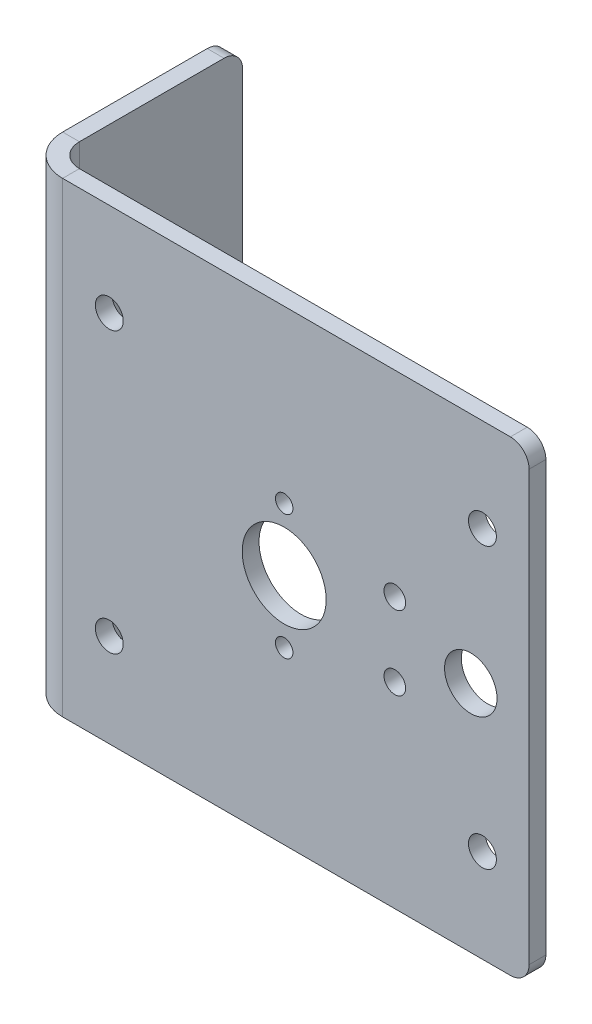
ISO-10303-21;
HEADER;
FILE_DESCRIPTION(('STEP AP214'),'2;1');
FILE_NAME('part.step','',(''),(''),'','','');
FILE_SCHEMA(('AUTOMOTIVE_DESIGN { 1 0 10303 214 1 1 1 1 }'));
ENDSEC;
DATA;
#1=APPLICATION_CONTEXT('core data for automotive mechanical design processes');
#2=APPLICATION_PROTOCOL_DEFINITION('international standard','automotive_design',2000,#1);
#3=PRODUCT_CONTEXT('',#1,'mechanical');
#4=PRODUCT('Part','Part','',(#3));
#5=PRODUCT_RELATED_PRODUCT_CATEGORY('part','',(#4));
#6=PRODUCT_DEFINITION_FORMATION('','',#4);
#7=PRODUCT_DEFINITION_CONTEXT('part definition',#1,'design');
#8=PRODUCT_DEFINITION('design','',#6,#7);
#9=PRODUCT_DEFINITION_SHAPE('','',#8);
#10=(LENGTH_UNIT() NAMED_UNIT(*) SI_UNIT(.MILLI.,.METRE.));
#11=(NAMED_UNIT(*) PLANE_ANGLE_UNIT() SI_UNIT($,.RADIAN.));
#12=(NAMED_UNIT(*) SI_UNIT($,.STERADIAN.) SOLID_ANGLE_UNIT());
#13=UNCERTAINTY_MEASURE_WITH_UNIT(LENGTH_MEASURE(1.E-05),#10,'distance_accuracy_value','');
#14=(GEOMETRIC_REPRESENTATION_CONTEXT(3) GLOBAL_UNCERTAINTY_ASSIGNED_CONTEXT((#13)) GLOBAL_UNIT_ASSIGNED_CONTEXT((#10,
#11,#12)) REPRESENTATION_CONTEXT('',''));
#15=CARTESIAN_POINT('',(0.,0.,0.));
#16=DIRECTION('',(0.,0.,1.));
#17=DIRECTION('',(1.,0.,0.));
#18=AXIS2_PLACEMENT_3D('',#15,#16,#17);
#19=CARTESIAN_POINT('',(-30.1625,31.75,0.));
#20=DIRECTION('',(0.,1.,0.));
#21=DIRECTION('',(0.,0.,1.));
#22=AXIS2_PLACEMENT_3D('',#19,#20,#21);
#23=PLANE('',#22);
#24=DIRECTION('',(0.,0.,1.));
#25=VECTOR('',#24,1.);
#26=CARTESIAN_POINT('',(-30.1625,31.75,0.));
#27=LINE('',#26,#25);
#28=CARTESIAN_POINT('',(-30.1625,31.75,0.));
#29=VERTEX_POINT('',#28);
#30=CARTESIAN_POINT('',(-30.1625,31.75,2.28600000000001));
#31=VERTEX_POINT('',#30);
#32=EDGE_CURVE('E150',#29,#31,#27,.T.);
#33=ORIENTED_EDGE('',*,*,#32,.F.);
#34=CARTESIAN_POINT('',(-30.1625,31.75,-3.17499999999999));
#35=DIRECTION('',(0.,1.,0.));
#36=DIRECTION('',(0.,0.,1.));
#37=AXIS2_PLACEMENT_3D('',#34,#35,#36);
#38=CIRCLE('',#37,3.175);
#39=CARTESIAN_POINT('',(-33.3375,31.75,-3.17499999999999));
#40=VERTEX_POINT('',#39);
#41=EDGE_CURVE('E147',#29,#40,#38,.F.);
#42=ORIENTED_EDGE('',*,*,#41,.T.);
#43=DIRECTION('',(1.,0.,0.));
#44=VECTOR('',#43,1.);
#45=CARTESIAN_POINT('',(-35.6235,31.75,-3.17499999999999));
#46=LINE('',#45,#44);
#47=CARTESIAN_POINT('',(-35.6235,31.75,-3.17499999999999));
#48=VERTEX_POINT('',#47);
#49=EDGE_CURVE('E141',#48,#40,#46,.T.);
#50=ORIENTED_EDGE('',*,*,#49,.F.);
#51=CARTESIAN_POINT('',(-30.1625,31.75,-3.17499999999999));
#52=DIRECTION('',(0.,1.,0.));
#53=DIRECTION('',(-1.,0.,0.));
#54=AXIS2_PLACEMENT_3D('',#51,#52,#53);
#55=CIRCLE('',#54,5.461);
#56=EDGE_CURVE('E145',#31,#48,#55,.F.);
#57=ORIENTED_EDGE('',*,*,#56,.F.);
#58=EDGE_LOOP('',(#33,#42,#50,#57));
#59=FACE_BOUND('',#58,.T.);
#60=ADVANCED_FACE('F47',(#59),#23,.T.);
#61=CARTESIAN_POINT('',(-35.6235,31.75,-3.17499999999999));
#62=DIRECTION('',(0.,1.,0.));
#63=DIRECTION('',(0.,0.,1.));
#64=AXIS2_PLACEMENT_3D('',#61,#62,#63);
#65=PLANE('',#64);
#66=DIRECTION('',(-1.,0.,0.));
#67=VECTOR('',#66,1.);
#68=CARTESIAN_POINT('',(33.3375,31.75,2.286));
#69=LINE('',#68,#67);
#70=CARTESIAN_POINT('',(30.7975,31.75,2.286));
#71=VERTEX_POINT('',#70);
#72=EDGE_CURVE('E177',#71,#31,#69,.T.);
#73=ORIENTED_EDGE('',*,*,#72,.F.);
#74=DIRECTION('',(0.,0.,1.));
#75=VECTOR('',#74,1.);
#76=CARTESIAN_POINT('',(30.7975,31.75,-3.17499999999999));
#77=LINE('',#76,#75);
#78=CARTESIAN_POINT('',(30.7975,31.75,0.));
#79=VERTEX_POINT('',#78);
#80=EDGE_CURVE('E11',#71,#79,#77,.F.);
#81=ORIENTED_EDGE('',*,*,#80,.T.);
#82=DIRECTION('',(-1.,0.,0.));
#83=VECTOR('',#82,1.);
#84=CARTESIAN_POINT('',(33.3375,31.75,0.));
#85=LINE('',#84,#83);
#86=EDGE_CURVE('E180',#79,#29,#85,.T.);
#87=ORIENTED_EDGE('',*,*,#86,.T.);
#88=ORIENTED_EDGE('',*,*,#32,.T.);
#89=EDGE_LOOP('',(#73,#81,#87,#88));
#90=FACE_BOUND('',#89,.T.);
#91=ADVANCED_FACE('F381',(#90),#65,.T.);
#92=CARTESIAN_POINT('',(-33.3375,-31.75,-3.17499999999999));
#93=DIRECTION('',(0.,-1.,0.));
#94=DIRECTION('',(0.,0.,-1.));
#95=AXIS2_PLACEMENT_3D('',#92,#93,#94);
#96=PLANE('',#95);
#97=DIRECTION('',(-1.,0.,0.));
#98=VECTOR('',#97,1.);
#99=CARTESIAN_POINT('',(-33.3375,-31.75,-3.17499999999999));
#100=LINE('',#99,#98);
#101=CARTESIAN_POINT('',(-33.3375,-31.75,-3.17499999999999));
#102=VERTEX_POINT('',#101);
#103=CARTESIAN_POINT('',(-35.6235,-31.75,-3.17499999999999));
#104=VERTEX_POINT('',#103);
#105=EDGE_CURVE('E151',#102,#104,#100,.T.);
#106=ORIENTED_EDGE('',*,*,#105,.F.);
#107=CARTESIAN_POINT('',(-30.1625,-31.75,-3.17499999999999));
#108=DIRECTION('',(0.,1.,0.));
#109=DIRECTION('',(0.,0.,1.));
#110=AXIS2_PLACEMENT_3D('',#107,#108,#109);
#111=CIRCLE('',#110,3.175);
#112=CARTESIAN_POINT('',(-30.1625,-31.75,0.));
#113=VERTEX_POINT('',#112);
#114=EDGE_CURVE('E205',#113,#102,#111,.F.);
#115=ORIENTED_EDGE('',*,*,#114,.F.);
#116=DIRECTION('',(0.,0.,-1.));
#117=VECTOR('',#116,1.);
#118=CARTESIAN_POINT('',(-30.1625,-31.75,2.28600000000001));
#119=LINE('',#118,#117);
#120=CARTESIAN_POINT('',(-30.1625,-31.75,2.28600000000001));
#121=VERTEX_POINT('',#120);
#122=EDGE_CURVE('E231',#121,#113,#119,.T.);
#123=ORIENTED_EDGE('',*,*,#122,.F.);
#124=CARTESIAN_POINT('',(-30.1625,-31.75,-3.17499999999999));
#125=DIRECTION('',(0.,1.,0.));
#126=DIRECTION('',(-1.,0.,0.));
#127=AXIS2_PLACEMENT_3D('',#124,#125,#126);
#128=CIRCLE('',#127,5.461);
#129=EDGE_CURVE('E196',#121,#104,#128,.F.);
#130=ORIENTED_EDGE('',*,*,#129,.T.);
#131=EDGE_LOOP('',(#106,#115,#123,#130));
#132=FACE_BOUND('',#131,.T.);
#133=ADVANCED_FACE('F360',(#132),#96,.T.);
#134=CARTESIAN_POINT('',(-30.1625,-31.75,2.28600000000001));
#135=DIRECTION('',(0.,-1.,0.));
#136=DIRECTION('',(0.,0.,-1.));
#137=AXIS2_PLACEMENT_3D('',#134,#135,#136);
#138=PLANE('',#137);
#139=DIRECTION('',(0.,0.,1.));
#140=VECTOR('',#139,1.);
#141=CARTESIAN_POINT('',(-35.6235,-31.75,0.));
#142=LINE('',#141,#140);
#143=CARTESIAN_POINT('',(-35.6235,-31.75,-22.86));
#144=VERTEX_POINT('',#143);
#145=EDGE_CURVE('E161',#104,#144,#142,.F.);
#146=ORIENTED_EDGE('',*,*,#145,.T.);
#147=DIRECTION('',(1.,0.,0.));
#148=VECTOR('',#147,1.);
#149=CARTESIAN_POINT('',(-30.1625,-31.75,-22.86));
#150=LINE('',#149,#148);
#151=CARTESIAN_POINT('',(-33.3375,-31.75,-22.86));
#152=VERTEX_POINT('',#151);
#153=EDGE_CURVE('E263',#144,#152,#150,.T.);
#154=ORIENTED_EDGE('',*,*,#153,.T.);
#155=DIRECTION('',(0.,0.,-1.));
#156=VECTOR('',#155,1.);
#157=CARTESIAN_POINT('',(-33.3375,-31.75,0.));
#158=LINE('',#157,#156);
#159=EDGE_CURVE('E189',#102,#152,#158,.T.);
#160=ORIENTED_EDGE('',*,*,#159,.F.);
#161=ORIENTED_EDGE('',*,*,#105,.T.);
#162=EDGE_LOOP('',(#146,#154,#160,#161));
#163=FACE_BOUND('',#162,.T.);
#164=ADVANCED_FACE('F357',(#163),#138,.T.);
#165=CARTESIAN_POINT('',(-33.3375,31.75,0.));
#166=DIRECTION('',(-1.,0.,0.));
#167=DIRECTION('',(0.,0.,1.));
#168=AXIS2_PLACEMENT_3D('',#165,#166,#167);
#169=PLANE('',#168);
#170=ORIENTED_EDGE('',*,*,#159,.T.);
#171=CARTESIAN_POINT('',(-33.3375,-29.21,-22.86));
#172=DIRECTION('',(-1.,0.,0.));
#173=DIRECTION('',(0.,0.,1.));
#174=AXIS2_PLACEMENT_3D('',#171,#172,#173);
#175=CIRCLE('',#174,2.54);
#176=CARTESIAN_POINT('',(-33.3375,-29.21,-25.4));
#177=VERTEX_POINT('',#176);
#178=EDGE_CURVE('E270',#152,#177,#175,.F.);
#179=ORIENTED_EDGE('',*,*,#178,.T.);
#180=DIRECTION('',(0.,-1.,0.));
#181=VECTOR('',#180,1.);
#182=CARTESIAN_POINT('',(-33.3375,31.75,-25.4));
#183=LINE('',#182,#181);
#184=CARTESIAN_POINT('',(-33.3375,29.21,-25.4));
#185=VERTEX_POINT('',#184);
#186=EDGE_CURVE('E228',#185,#177,#183,.T.);
#187=ORIENTED_EDGE('',*,*,#186,.F.);
#188=CARTESIAN_POINT('',(-33.3375,29.21,-22.86));
#189=DIRECTION('',(-1.,0.,0.));
#190=DIRECTION('',(0.,0.,1.));
#191=AXIS2_PLACEMENT_3D('',#188,#189,#190);
#192=CIRCLE('',#191,2.54);
#193=CARTESIAN_POINT('',(-33.3375,31.75,-22.86));
#194=VERTEX_POINT('',#193);
#195=EDGE_CURVE('E267',#185,#194,#192,.F.);
#196=ORIENTED_EDGE('',*,*,#195,.T.);
#197=DIRECTION('',(0.,0.,-1.));
#198=VECTOR('',#197,1.);
#199=CARTESIAN_POINT('',(-33.3375,31.75,0.));
#200=LINE('',#199,#198);
#201=EDGE_CURVE('E171',#40,#194,#200,.T.);
#202=ORIENTED_EDGE('',*,*,#201,.F.);
#203=DIRECTION('',(0.,-1.,0.));
#204=VECTOR('',#203,1.);
#205=CARTESIAN_POINT('',(-33.3375,31.75,-3.17499999999999));
#206=LINE('',#205,#204);
#207=EDGE_CURVE('E188',#40,#102,#206,.T.);
#208=ORIENTED_EDGE('',*,*,#207,.T.);
#209=EDGE_LOOP('',(#170,#179,#187,#196,#202,#208));
#210=FACE_BOUND('',#209,.T.);
#211=ADVANCED_FACE('F351',(#210),#169,.F.);
#212=CARTESIAN_POINT('',(-35.6235,31.75,-25.4));
#213=DIRECTION('',(0.,0.,-1.));
#214=DIRECTION('',(-1.,0.,0.));
#215=AXIS2_PLACEMENT_3D('',#212,#213,#214);
#216=PLANE('',#215);
#217=ORIENTED_EDGE('',*,*,#186,.T.);
#218=DIRECTION('',(1.,0.,0.));
#219=VECTOR('',#218,1.);
#220=CARTESIAN_POINT('',(-35.6235,-29.21,-25.4));
#221=LINE('',#220,#219);
#222=CARTESIAN_POINT('',(-35.6235,-29.21,-25.4));
#223=VERTEX_POINT('',#222);
#224=EDGE_CURVE('E72',#177,#223,#221,.F.);
#225=ORIENTED_EDGE('',*,*,#224,.T.);
#226=DIRECTION('',(0.,-1.,0.));
#227=VECTOR('',#226,1.);
#228=CARTESIAN_POINT('',(-35.6235,31.75,-25.4));
#229=LINE('',#228,#227);
#230=CARTESIAN_POINT('',(-35.6235,29.21,-25.4));
#231=VERTEX_POINT('',#230);
#232=EDGE_CURVE('E166',#231,#223,#229,.T.);
#233=ORIENTED_EDGE('',*,*,#232,.F.);
#234=DIRECTION('',(1.,0.,0.));
#235=VECTOR('',#234,1.);
#236=CARTESIAN_POINT('',(-35.6235,29.21,-25.4));
#237=LINE('',#236,#235);
#238=EDGE_CURVE('E273',#231,#185,#237,.T.);
#239=ORIENTED_EDGE('',*,*,#238,.T.);
#240=EDGE_LOOP('',(#217,#225,#233,#239));
#241=FACE_BOUND('',#240,.T.);
#242=ADVANCED_FACE('F349',(#241),#216,.T.);
#243=CARTESIAN_POINT('',(-35.6235,31.75,0.));
#244=DIRECTION('',(-1.,0.,0.));
#245=DIRECTION('',(0.,0.,1.));
#246=AXIS2_PLACEMENT_3D('',#243,#244,#245);
#247=PLANE('',#246);
#248=ORIENTED_EDGE('',*,*,#232,.T.);
#249=CARTESIAN_POINT('',(-35.6235,-29.21,-22.86));
#250=DIRECTION('',(-1.,0.,0.));
#251=DIRECTION('',(0.,0.,1.));
#252=AXIS2_PLACEMENT_3D('',#249,#250,#251);
#253=CIRCLE('',#252,2.54);
#254=EDGE_CURVE('E282',#223,#144,#253,.T.);
#255=ORIENTED_EDGE('',*,*,#254,.T.);
#256=ORIENTED_EDGE('',*,*,#145,.F.);
#257=DIRECTION('',(0.,-1.,0.));
#258=VECTOR('',#257,1.);
#259=CARTESIAN_POINT('',(-35.6235,31.75,-3.17499999999999));
#260=LINE('',#259,#258);
#261=EDGE_CURVE('E156',#48,#104,#260,.T.);
#262=ORIENTED_EDGE('',*,*,#261,.F.);
#263=DIRECTION('',(0.,0.,1.));
#264=VECTOR('',#263,1.);
#265=CARTESIAN_POINT('',(-35.6235,31.75,0.));
#266=LINE('',#265,#264);
#267=CARTESIAN_POINT('',(-35.6235,31.75,-22.86));
#268=VERTEX_POINT('',#267);
#269=EDGE_CURVE('E158',#48,#268,#266,.F.);
#270=ORIENTED_EDGE('',*,*,#269,.T.);
#271=CARTESIAN_POINT('',(-35.6235,29.21,-22.86));
#272=DIRECTION('',(-1.,0.,0.));
#273=DIRECTION('',(0.,0.,1.));
#274=AXIS2_PLACEMENT_3D('',#271,#272,#273);
#275=CIRCLE('',#274,2.54);
#276=EDGE_CURVE('E279',#268,#231,#275,.T.);
#277=ORIENTED_EDGE('',*,*,#276,.T.);
#278=EDGE_LOOP('',(#248,#255,#256,#262,#270,#277));
#279=FACE_BOUND('',#278,.T.);
#280=ADVANCED_FACE('F157',(#279),#247,.T.);
#281=CARTESIAN_POINT('',(-30.1625,31.75,-3.17499999999999));
#282=DIRECTION('',(0.,-1.,0.));
#283=DIRECTION('',(0.,0.,-1.));
#284=AXIS2_PLACEMENT_3D('',#281,#282,#283);
#285=CYLINDRICAL_SURFACE('',#284,5.461);
#286=ORIENTED_EDGE('',*,*,#129,.F.);
#287=DIRECTION('',(0.,-1.,0.));
#288=VECTOR('',#287,1.);
#289=CARTESIAN_POINT('',(-30.1625,31.75,2.28600000000001));
#290=LINE('',#289,#288);
#291=EDGE_CURVE('E167',#31,#121,#290,.T.);
#292=ORIENTED_EDGE('',*,*,#291,.F.);
#293=ORIENTED_EDGE('',*,*,#56,.T.);
#294=ORIENTED_EDGE('',*,*,#261,.T.);
#295=EDGE_LOOP('',(#286,#292,#293,#294));
#296=FACE_BOUND('',#295,.T.);
#297=ADVANCED_FACE('F174',(#296),#285,.T.);
#298=CARTESIAN_POINT('',(33.3375,31.75,2.286));
#299=DIRECTION('',(0.,0.,1.));
#300=DIRECTION('',(1.,0.,0.));
#301=AXIS2_PLACEMENT_3D('',#298,#299,#300);
#302=PLANE('',#301);
#303=CARTESIAN_POINT('',(15.0578841816037,5.027499276321,2.28600000000001));
#304=DIRECTION('',(0.,0.,1.));
#305=DIRECTION('',(1.,0.,0.));
#306=AXIS2_PLACEMENT_3D('',#303,#304,#305);
#307=CIRCLE('',#306,1.4732);
#308=CARTESIAN_POINT('',(16.5310841816037,5.027499276321,2.28600000000001));
#309=VERTEX_POINT('',#308);
#310=EDGE_CURVE('E472',#309,#309,#307,.T.);
#311=ORIENTED_EDGE('',*,*,#310,.F.);
#312=EDGE_LOOP('',(#311));
#313=FACE_BOUND('',#312,.T.);
#314=CARTESIAN_POINT('',(15.0578841816037,-5.027499276321,2.28600000000001));
#315=DIRECTION('',(0.,0.,1.));
#316=DIRECTION('',(1.,0.,0.));
#317=AXIS2_PLACEMENT_3D('',#314,#315,#316);
#318=CIRCLE('',#317,1.4732);
#319=CARTESIAN_POINT('',(16.5310841816037,-5.027499276321,2.28600000000001));
#320=VERTEX_POINT('',#319);
#321=EDGE_CURVE('E476',#320,#320,#318,.T.);
#322=ORIENTED_EDGE('',*,*,#321,.F.);
#323=EDGE_LOOP('',(#322));
#324=FACE_BOUND('',#323,.T.);
#325=CARTESIAN_POINT('',(0.,8.5,2.28600000000001));
#326=DIRECTION('',(0.,0.,1.));
#327=DIRECTION('',(1.,0.,0.));
#328=AXIS2_PLACEMENT_3D('',#325,#326,#327);
#329=CIRCLE('',#328,1.190625);
#330=CARTESIAN_POINT('',(1.190625,8.5,2.28600000000001));
#331=VERTEX_POINT('',#330);
#332=EDGE_CURVE('E487',#331,#331,#329,.T.);
#333=ORIENTED_EDGE('',*,*,#332,.F.);
#334=EDGE_LOOP('',(#333));
#335=FACE_BOUND('',#334,.T.);
#336=CARTESIAN_POINT('',(0.,-8.5,2.28600000000001));
#337=DIRECTION('',(0.,0.,1.));
#338=DIRECTION('',(1.,0.,0.));
#339=AXIS2_PLACEMENT_3D('',#336,#337,#338);
#340=CIRCLE('',#339,1.190625);
#341=CARTESIAN_POINT('',(1.190625,-8.5,2.28600000000001));
#342=VERTEX_POINT('',#341);
#343=EDGE_CURVE('E324',#342,#342,#340,.T.);
#344=ORIENTED_EDGE('',*,*,#343,.F.);
#345=EDGE_LOOP('',(#344));
#346=FACE_BOUND('',#345,.T.);
#347=CARTESIAN_POINT('',(25.4,0.,2.28600000000001));
#348=DIRECTION('',(0.,0.,1.));
#349=DIRECTION('',(1.,0.,0.));
#350=AXIS2_PLACEMENT_3D('',#347,#348,#349);
#351=CIRCLE('',#350,3.571875);
#352=CARTESIAN_POINT('',(28.971875,0.,2.28600000000001));
#353=VERTEX_POINT('',#352);
#354=EDGE_CURVE('E310',#353,#353,#351,.T.);
#355=ORIENTED_EDGE('',*,*,#354,.F.);
#356=EDGE_LOOP('',(#355));
#357=FACE_BOUND('',#356,.T.);
#358=CARTESIAN_POINT('',(0.,0.,2.28600000000001));
#359=DIRECTION('',(0.,0.,1.));
#360=DIRECTION('',(1.,0.,0.));
#361=AXIS2_PLACEMENT_3D('',#358,#359,#360);
#362=CIRCLE('',#361,5.715);
#363=CARTESIAN_POINT('',(5.715,0.,2.28600000000001));
#364=VERTEX_POINT('',#363);
#365=EDGE_CURVE('E306',#364,#364,#362,.T.);
#366=ORIENTED_EDGE('',*,*,#365,.F.);
#367=EDGE_LOOP('',(#366));
#368=FACE_BOUND('',#367,.T.);
#369=CARTESIAN_POINT('',(-23.8125,19.05,2.28600000000001));
#370=DIRECTION('',(0.,0.,1.));
#371=DIRECTION('',(1.,0.,0.));
#372=AXIS2_PLACEMENT_3D('',#369,#370,#371);
#373=CIRCLE('',#372,1.89865);
#374=CARTESIAN_POINT('',(-21.91385,19.05,2.28600000000001));
#375=VERTEX_POINT('',#374);
#376=EDGE_CURVE('E302',#375,#375,#373,.T.);
#377=ORIENTED_EDGE('',*,*,#376,.F.);
#378=EDGE_LOOP('',(#377));
#379=FACE_BOUND('',#378,.T.);
#380=CARTESIAN_POINT('',(26.9875,19.05,2.28600000000001));
#381=DIRECTION('',(0.,0.,1.));
#382=DIRECTION('',(1.,0.,0.));
#383=AXIS2_PLACEMENT_3D('',#380,#381,#382);
#384=CIRCLE('',#383,1.89865);
#385=CARTESIAN_POINT('',(28.88615,19.05,2.28600000000001));
#386=VERTEX_POINT('',#385);
#387=EDGE_CURVE('E297',#386,#386,#384,.T.);
#388=ORIENTED_EDGE('',*,*,#387,.F.);
#389=EDGE_LOOP('',(#388));
#390=FACE_BOUND('',#389,.T.);
#391=CARTESIAN_POINT('',(26.9875,-19.05,2.28600000000001));
#392=DIRECTION('',(0.,0.,1.));
#393=DIRECTION('',(1.,0.,0.));
#394=AXIS2_PLACEMENT_3D('',#391,#392,#393);
#395=CIRCLE('',#394,1.89865);
#396=CARTESIAN_POINT('',(28.88615,-19.05,2.28600000000001));
#397=VERTEX_POINT('',#396);
#398=EDGE_CURVE('E292',#397,#397,#395,.T.);
#399=ORIENTED_EDGE('',*,*,#398,.F.);
#400=EDGE_LOOP('',(#399));
#401=FACE_BOUND('',#400,.T.);
#402=CARTESIAN_POINT('',(-23.8125,-19.05,2.28600000000001));
#403=DIRECTION('',(0.,0.,1.));
#404=DIRECTION('',(1.,0.,0.));
#405=AXIS2_PLACEMENT_3D('',#402,#403,#404);
#406=CIRCLE('',#405,1.89865);
#407=CARTESIAN_POINT('',(-21.91385,-19.05,2.28600000000001));
#408=VERTEX_POINT('',#407);
#409=EDGE_CURVE('E291',#408,#408,#406,.T.);
#410=ORIENTED_EDGE('',*,*,#409,.F.);
#411=EDGE_LOOP('',(#410));
#412=FACE_BOUND('',#411,.T.);
#413=DIRECTION('',(-1.,0.,0.));
#414=VECTOR('',#413,1.);
#415=CARTESIAN_POINT('',(33.3375,-31.75,2.286));
#416=LINE('',#415,#414);
#417=CARTESIAN_POINT('',(30.7975,-31.75,2.286));
#418=VERTEX_POINT('',#417);
#419=EDGE_CURVE('E199',#418,#121,#416,.T.);
#420=ORIENTED_EDGE('',*,*,#419,.F.);
#421=CARTESIAN_POINT('',(30.7975,-29.21,2.286));
#422=DIRECTION('',(0.,0.,1.));
#423=DIRECTION('',(1.,0.,0.));
#424=AXIS2_PLACEMENT_3D('',#421,#422,#423);
#425=CIRCLE('',#424,2.54);
#426=CARTESIAN_POINT('',(33.3375,-29.21,2.286));
#427=VERTEX_POINT('',#426);
#428=EDGE_CURVE('E247',#418,#427,#425,.T.);
#429=ORIENTED_EDGE('',*,*,#428,.T.);
#430=DIRECTION('',(0.,-1.,0.));
#431=VECTOR('',#430,1.);
#432=CARTESIAN_POINT('',(33.3375,31.75,2.286));
#433=LINE('',#432,#431);
#434=CARTESIAN_POINT('',(33.3375,29.21,2.286));
#435=VERTEX_POINT('',#434);
#436=EDGE_CURVE('E220',#435,#427,#433,.T.);
#437=ORIENTED_EDGE('',*,*,#436,.F.);
#438=CARTESIAN_POINT('',(30.7975,29.21,2.286));
#439=DIRECTION('',(0.,0.,1.));
#440=DIRECTION('',(1.,0.,0.));
#441=AXIS2_PLACEMENT_3D('',#438,#439,#440);
#442=CIRCLE('',#441,2.54);
#443=EDGE_CURVE('E244',#435,#71,#442,.T.);
#444=ORIENTED_EDGE('',*,*,#443,.T.);
#445=ORIENTED_EDGE('',*,*,#72,.T.);
#446=ORIENTED_EDGE('',*,*,#291,.T.);
#447=EDGE_LOOP('',(#420,#429,#437,#444,#445,#446));
#448=FACE_BOUND('',#447,.T.);
#449=ADVANCED_FACE('F376',(#313,#324,#335,#346,#357,#368,#379,#390,#401,#412,#448),#302,.T.);
#450=CARTESIAN_POINT('',(33.3375,31.75,0.));
#451=DIRECTION('',(1.,0.,0.));
#452=DIRECTION('',(0.,0.,-1.));
#453=AXIS2_PLACEMENT_3D('',#450,#451,#452);
#454=PLANE('',#453);
#455=ORIENTED_EDGE('',*,*,#436,.T.);
#456=DIRECTION('',(0.,0.,1.));
#457=VECTOR('',#456,1.);
#458=CARTESIAN_POINT('',(33.3375,-29.21,0.));
#459=LINE('',#458,#457);
#460=CARTESIAN_POINT('',(33.3375,-29.21,0.));
#461=VERTEX_POINT('',#460);
#462=EDGE_CURVE('E254',#427,#461,#459,.F.);
#463=ORIENTED_EDGE('',*,*,#462,.T.);
#464=DIRECTION('',(0.,-1.,0.));
#465=VECTOR('',#464,1.);
#466=CARTESIAN_POINT('',(33.3375,31.75,0.));
#467=LINE('',#466,#465);
#468=CARTESIAN_POINT('',(33.3375,29.21,0.));
#469=VERTEX_POINT('',#468);
#470=EDGE_CURVE('E216',#469,#461,#467,.T.);
#471=ORIENTED_EDGE('',*,*,#470,.F.);
#472=DIRECTION('',(0.,0.,1.));
#473=VECTOR('',#472,1.);
#474=CARTESIAN_POINT('',(33.3375,29.21,0.));
#475=LINE('',#474,#473);
#476=EDGE_CURVE('E250',#469,#435,#475,.T.);
#477=ORIENTED_EDGE('',*,*,#476,.T.);
#478=EDGE_LOOP('',(#455,#463,#471,#477));
#479=FACE_BOUND('',#478,.T.);
#480=ADVANCED_FACE('F386',(#479),#454,.T.);
#481=CARTESIAN_POINT('',(33.3375,31.75,0.));
#482=DIRECTION('',(0.,0.,1.));
#483=DIRECTION('',(1.,0.,0.));
#484=AXIS2_PLACEMENT_3D('',#481,#482,#483);
#485=PLANE('',#484);
#486=CARTESIAN_POINT('',(15.0578841816037,5.027499276321,0.));
#487=DIRECTION('',(0.,0.,1.));
#488=DIRECTION('',(1.,0.,0.));
#489=AXIS2_PLACEMENT_3D('',#486,#487,#488);
#490=CIRCLE('',#489,1.47319999999999);
#491=CARTESIAN_POINT('',(16.5310841816037,5.027499276321,0.));
#492=VERTEX_POINT('',#491);
#493=EDGE_CURVE('E51',#492,#492,#490,.T.);
#494=ORIENTED_EDGE('',*,*,#493,.T.);
#495=EDGE_LOOP('',(#494));
#496=FACE_BOUND('',#495,.T.);
#497=CARTESIAN_POINT('',(15.0578841816037,-5.027499276321,0.));
#498=DIRECTION('',(0.,0.,1.));
#499=DIRECTION('',(1.,0.,0.));
#500=AXIS2_PLACEMENT_3D('',#497,#498,#499);
#501=CIRCLE('',#500,1.47319999999999);
#502=CARTESIAN_POINT('',(16.5310841816037,-5.027499276321,0.));
#503=VERTEX_POINT('',#502);
#504=EDGE_CURVE('E480',#503,#503,#501,.T.);
#505=ORIENTED_EDGE('',*,*,#504,.T.);
#506=EDGE_LOOP('',(#505));
#507=FACE_BOUND('',#506,.T.);
#508=CARTESIAN_POINT('',(0.,8.5,0.));
#509=DIRECTION('',(0.,0.,1.));
#510=DIRECTION('',(1.,0.,0.));
#511=AXIS2_PLACEMENT_3D('',#508,#509,#510);
#512=CIRCLE('',#511,1.190625);
#513=CARTESIAN_POINT('',(1.190625,8.5,0.));
#514=VERTEX_POINT('',#513);
#515=EDGE_CURVE('E491',#514,#514,#512,.T.);
#516=ORIENTED_EDGE('',*,*,#515,.T.);
#517=EDGE_LOOP('',(#516));
#518=FACE_BOUND('',#517,.T.);
#519=CARTESIAN_POINT('',(0.,-8.5,0.));
#520=DIRECTION('',(0.,0.,1.));
#521=DIRECTION('',(1.,0.,0.));
#522=AXIS2_PLACEMENT_3D('',#519,#520,#521);
#523=CIRCLE('',#522,1.190625);
#524=CARTESIAN_POINT('',(1.190625,-8.5,0.));
#525=VERTEX_POINT('',#524);
#526=EDGE_CURVE('E318',#525,#525,#523,.T.);
#527=ORIENTED_EDGE('',*,*,#526,.T.);
#528=EDGE_LOOP('',(#527));
#529=FACE_BOUND('',#528,.T.);
#530=CARTESIAN_POINT('',(25.4,0.,0.));
#531=DIRECTION('',(0.,0.,1.));
#532=DIRECTION('',(1.,0.,0.));
#533=AXIS2_PLACEMENT_3D('',#530,#531,#532);
#534=CIRCLE('',#533,3.571875);
#535=CARTESIAN_POINT('',(28.971875,0.,0.));
#536=VERTEX_POINT('',#535);
#537=EDGE_CURVE('E307',#536,#536,#534,.T.);
#538=ORIENTED_EDGE('',*,*,#537,.T.);
#539=EDGE_LOOP('',(#538));
#540=FACE_BOUND('',#539,.T.);
#541=CARTESIAN_POINT('',(0.,0.,0.));
#542=DIRECTION('',(0.,0.,1.));
#543=DIRECTION('',(1.,0.,0.));
#544=AXIS2_PLACEMENT_3D('',#541,#542,#543);
#545=CIRCLE('',#544,5.715);
#546=CARTESIAN_POINT('',(5.715,0.,0.));
#547=VERTEX_POINT('',#546);
#548=EDGE_CURVE('E303',#547,#547,#545,.T.);
#549=ORIENTED_EDGE('',*,*,#548,.T.);
#550=EDGE_LOOP('',(#549));
#551=FACE_BOUND('',#550,.T.);
#552=CARTESIAN_POINT('',(-23.8125,19.05,0.));
#553=DIRECTION('',(0.,0.,1.));
#554=DIRECTION('',(1.,0.,0.));
#555=AXIS2_PLACEMENT_3D('',#552,#553,#554);
#556=CIRCLE('',#555,1.89865);
#557=CARTESIAN_POINT('',(-21.91385,19.05,0.));
#558=VERTEX_POINT('',#557);
#559=EDGE_CURVE('E298',#558,#558,#556,.T.);
#560=ORIENTED_EDGE('',*,*,#559,.T.);
#561=EDGE_LOOP('',(#560));
#562=FACE_BOUND('',#561,.T.);
#563=CARTESIAN_POINT('',(26.9875,19.05,0.));
#564=DIRECTION('',(0.,0.,1.));
#565=DIRECTION('',(1.,0.,0.));
#566=AXIS2_PLACEMENT_3D('',#563,#564,#565);
#567=CIRCLE('',#566,1.89865);
#568=CARTESIAN_POINT('',(28.88615,19.05,0.));
#569=VERTEX_POINT('',#568);
#570=EDGE_CURVE('E293',#569,#569,#567,.T.);
#571=ORIENTED_EDGE('',*,*,#570,.T.);
#572=EDGE_LOOP('',(#571));
#573=FACE_BOUND('',#572,.T.);
#574=CARTESIAN_POINT('',(26.9875,-19.05,0.));
#575=DIRECTION('',(0.,0.,1.));
#576=DIRECTION('',(1.,0.,0.));
#577=AXIS2_PLACEMENT_3D('',#574,#575,#576);
#578=CIRCLE('',#577,1.89865);
#579=CARTESIAN_POINT('',(28.88615,-19.05,0.));
#580=VERTEX_POINT('',#579);
#581=EDGE_CURVE('E287',#580,#580,#578,.T.);
#582=ORIENTED_EDGE('',*,*,#581,.T.);
#583=EDGE_LOOP('',(#582));
#584=FACE_BOUND('',#583,.T.);
#585=CARTESIAN_POINT('',(-23.8125,-19.05,0.));
#586=DIRECTION('',(0.,0.,1.));
#587=DIRECTION('',(1.,0.,0.));
#588=AXIS2_PLACEMENT_3D('',#585,#586,#587);
#589=CIRCLE('',#588,1.89865);
#590=CARTESIAN_POINT('',(-21.91385,-19.05,0.));
#591=VERTEX_POINT('',#590);
#592=EDGE_CURVE('E193',#591,#591,#589,.T.);
#593=ORIENTED_EDGE('',*,*,#592,.T.);
#594=EDGE_LOOP('',(#593));
#595=FACE_BOUND('',#594,.T.);
#596=ORIENTED_EDGE('',*,*,#470,.T.);
#597=CARTESIAN_POINT('',(30.7975,-29.21,0.));
#598=DIRECTION('',(0.,0.,1.));
#599=DIRECTION('',(1.,0.,0.));
#600=AXIS2_PLACEMENT_3D('',#597,#598,#599);
#601=CIRCLE('',#600,2.54);
#602=CARTESIAN_POINT('',(30.7975,-31.75,0.));
#603=VERTEX_POINT('',#602);
#604=EDGE_CURVE('E260',#461,#603,#601,.F.);
#605=ORIENTED_EDGE('',*,*,#604,.T.);
#606=DIRECTION('',(-1.,0.,0.));
#607=VECTOR('',#606,1.);
#608=CARTESIAN_POINT('',(33.3375,-31.75,0.));
#609=LINE('',#608,#607);
#610=EDGE_CURVE('E202',#603,#113,#609,.T.);
#611=ORIENTED_EDGE('',*,*,#610,.T.);
#612=DIRECTION('',(0.,-1.,0.));
#613=VECTOR('',#612,1.);
#614=CARTESIAN_POINT('',(-30.1625,31.75,0.));
#615=LINE('',#614,#613);
#616=EDGE_CURVE('E212',#29,#113,#615,.T.);
#617=ORIENTED_EDGE('',*,*,#616,.F.);
#618=ORIENTED_EDGE('',*,*,#86,.F.);
#619=CARTESIAN_POINT('',(30.7975,29.21,0.));
#620=DIRECTION('',(0.,0.,1.));
#621=DIRECTION('',(1.,0.,0.));
#622=AXIS2_PLACEMENT_3D('',#619,#620,#621);
#623=CIRCLE('',#622,2.54);
#624=EDGE_CURVE('E257',#79,#469,#623,.F.);
#625=ORIENTED_EDGE('',*,*,#624,.T.);
#626=EDGE_LOOP('',(#596,#605,#611,#617,#618,#625));
#627=FACE_BOUND('',#626,.T.);
#628=ADVANCED_FACE('F367',(#496,#507,#518,#529,#540,#551,#562,#573,#584,#595,#627),#485,.F.);
#629=CARTESIAN_POINT('',(-30.1625,31.75,-3.17499999999999));
#630=DIRECTION('',(0.,-1.,0.));
#631=DIRECTION('',(0.,0.,-1.));
#632=AXIS2_PLACEMENT_3D('',#629,#630,#631);
#633=CYLINDRICAL_SURFACE('',#632,3.175);
#634=ORIENTED_EDGE('',*,*,#114,.T.);
#635=ORIENTED_EDGE('',*,*,#207,.F.);
#636=ORIENTED_EDGE('',*,*,#41,.F.);
#637=ORIENTED_EDGE('',*,*,#616,.T.);
#638=EDGE_LOOP('',(#634,#635,#636,#637));
#639=FACE_BOUND('',#638,.T.);
#640=ADVANCED_FACE('F363',(#639),#633,.F.);
#641=CARTESIAN_POINT('',(-30.1625,31.75,-3.17499999999999));
#642=DIRECTION('',(0.,1.,0.));
#643=DIRECTION('',(-1.,0.,0.));
#644=AXIS2_PLACEMENT_3D('',#641,#642,#643);
#645=PLANE('',#644);
#646=ORIENTED_EDGE('',*,*,#201,.T.);
#647=DIRECTION('',(1.,0.,0.));
#648=VECTOR('',#647,1.);
#649=CARTESIAN_POINT('',(-30.1625,31.75,-22.86));
#650=LINE('',#649,#648);
#651=EDGE_CURVE('E57',#194,#268,#650,.F.);
#652=ORIENTED_EDGE('',*,*,#651,.T.);
#653=ORIENTED_EDGE('',*,*,#269,.F.);
#654=ORIENTED_EDGE('',*,*,#49,.T.);
#655=EDGE_LOOP('',(#646,#652,#653,#654));
#656=FACE_BOUND('',#655,.T.);
#657=ADVANCED_FACE('F169',(#656),#645,.T.);
#658=CARTESIAN_POINT('',(-30.1625,-31.75,-3.17499999999999));
#659=DIRECTION('',(0.,1.,0.));
#660=DIRECTION('',(-1.,0.,0.));
#661=AXIS2_PLACEMENT_3D('',#658,#659,#660);
#662=PLANE('',#661);
#663=ORIENTED_EDGE('',*,*,#610,.F.);
#664=DIRECTION('',(0.,0.,1.));
#665=VECTOR('',#664,1.);
#666=CARTESIAN_POINT('',(30.7975,-31.75,2.286));
#667=LINE('',#666,#665);
#668=EDGE_CURVE('E240',#603,#418,#667,.T.);
#669=ORIENTED_EDGE('',*,*,#668,.T.);
#670=ORIENTED_EDGE('',*,*,#419,.T.);
#671=ORIENTED_EDGE('',*,*,#122,.T.);
#672=EDGE_LOOP('',(#663,#669,#670,#671));
#673=FACE_BOUND('',#672,.T.);
#674=ADVANCED_FACE('F373',(#673),#662,.F.);
#675=CARTESIAN_POINT('',(30.7975,-29.21,-3.17499999999999));
#676=DIRECTION('',(0.,0.,-1.));
#677=DIRECTION('',(-1.,0.,0.));
#678=AXIS2_PLACEMENT_3D('',#675,#676,#677);
#679=CYLINDRICAL_SURFACE('',#678,2.54);
#680=ORIENTED_EDGE('',*,*,#604,.F.);
#681=ORIENTED_EDGE('',*,*,#462,.F.);
#682=ORIENTED_EDGE('',*,*,#428,.F.);
#683=ORIENTED_EDGE('',*,*,#668,.F.);
#684=EDGE_LOOP('',(#680,#681,#682,#683));
#685=FACE_BOUND('',#684,.T.);
#686=ADVANCED_FACE('F389',(#685),#679,.T.);
#687=CARTESIAN_POINT('',(-30.1625,-29.21,-22.86));
#688=DIRECTION('',(1.,0.,0.));
#689=DIRECTION('',(0.,0.,-1.));
#690=AXIS2_PLACEMENT_3D('',#687,#688,#689);
#691=CYLINDRICAL_SURFACE('',#690,2.54);
#692=ORIENTED_EDGE('',*,*,#254,.F.);
#693=ORIENTED_EDGE('',*,*,#224,.F.);
#694=ORIENTED_EDGE('',*,*,#178,.F.);
#695=ORIENTED_EDGE('',*,*,#153,.F.);
#696=EDGE_LOOP('',(#692,#693,#694,#695));
#697=FACE_BOUND('',#696,.T.);
#698=ADVANCED_FACE('F355',(#697),#691,.T.);
#699=CARTESIAN_POINT('',(-35.6235,29.21,-22.86));
#700=DIRECTION('',(1.,0.,0.));
#701=DIRECTION('',(0.,0.,-1.));
#702=AXIS2_PLACEMENT_3D('',#699,#700,#701);
#703=CYLINDRICAL_SURFACE('',#702,2.54);
#704=ORIENTED_EDGE('',*,*,#276,.F.);
#705=ORIENTED_EDGE('',*,*,#651,.F.);
#706=ORIENTED_EDGE('',*,*,#195,.F.);
#707=ORIENTED_EDGE('',*,*,#238,.F.);
#708=EDGE_LOOP('',(#704,#705,#706,#707));
#709=FACE_BOUND('',#708,.T.);
#710=ADVANCED_FACE('F346',(#709),#703,.T.);
#711=CARTESIAN_POINT('',(30.7975,29.21,0.));
#712=DIRECTION('',(0.,0.,1.));
#713=DIRECTION('',(1.,0.,0.));
#714=AXIS2_PLACEMENT_3D('',#711,#712,#713);
#715=CYLINDRICAL_SURFACE('',#714,2.54);
#716=ORIENTED_EDGE('',*,*,#624,.F.);
#717=ORIENTED_EDGE('',*,*,#80,.F.);
#718=ORIENTED_EDGE('',*,*,#443,.F.);
#719=ORIENTED_EDGE('',*,*,#476,.F.);
#720=EDGE_LOOP('',(#716,#717,#718,#719));
#721=FACE_BOUND('',#720,.T.);
#722=ADVANCED_FACE('F49',(#721),#715,.T.);
#723=CARTESIAN_POINT('',(-23.8125,-19.05,2.28600000000001));
#724=DIRECTION('',(0.,0.,1.));
#725=DIRECTION('',(1.,0.,0.));
#726=AXIS2_PLACEMENT_3D('',#723,#724,#725);
#727=CYLINDRICAL_SURFACE('',#726,1.89865);
#728=ORIENTED_EDGE('',*,*,#409,.T.);
#729=EDGE_LOOP('',(#728));
#730=FACE_BOUND('',#729,.T.);
#731=ORIENTED_EDGE('',*,*,#592,.F.);
#732=EDGE_LOOP('',(#731));
#733=FACE_BOUND('',#732,.T.);
#734=ADVANCED_FACE('F429',(#730,#733),#727,.F.);
#735=CARTESIAN_POINT('',(26.9875,-19.05,2.28600000000001));
#736=DIRECTION('',(0.,0.,1.));
#737=DIRECTION('',(1.,0.,0.));
#738=AXIS2_PLACEMENT_3D('',#735,#736,#737);
#739=CYLINDRICAL_SURFACE('',#738,1.89865);
#740=ORIENTED_EDGE('',*,*,#398,.T.);
#741=EDGE_LOOP('',(#740));
#742=FACE_BOUND('',#741,.T.);
#743=ORIENTED_EDGE('',*,*,#581,.F.);
#744=EDGE_LOOP('',(#743));
#745=FACE_BOUND('',#744,.T.);
#746=ADVANCED_FACE('F432',(#742,#745),#739,.F.);
#747=CARTESIAN_POINT('',(26.9875,19.05,2.28600000000001));
#748=DIRECTION('',(0.,0.,1.));
#749=DIRECTION('',(1.,0.,0.));
#750=AXIS2_PLACEMENT_3D('',#747,#748,#749);
#751=CYLINDRICAL_SURFACE('',#750,1.89865);
#752=ORIENTED_EDGE('',*,*,#387,.T.);
#753=EDGE_LOOP('',(#752));
#754=FACE_BOUND('',#753,.T.);
#755=ORIENTED_EDGE('',*,*,#570,.F.);
#756=EDGE_LOOP('',(#755));
#757=FACE_BOUND('',#756,.T.);
#758=ADVANCED_FACE('F436',(#754,#757),#751,.F.);
#759=CARTESIAN_POINT('',(-23.8125,19.05,2.28600000000001));
#760=DIRECTION('',(0.,0.,1.));
#761=DIRECTION('',(1.,0.,0.));
#762=AXIS2_PLACEMENT_3D('',#759,#760,#761);
#763=CYLINDRICAL_SURFACE('',#762,1.89865);
#764=ORIENTED_EDGE('',*,*,#376,.T.);
#765=EDGE_LOOP('',(#764));
#766=FACE_BOUND('',#765,.T.);
#767=ORIENTED_EDGE('',*,*,#559,.F.);
#768=EDGE_LOOP('',(#767));
#769=FACE_BOUND('',#768,.T.);
#770=ADVANCED_FACE('F440',(#766,#769),#763,.F.);
#771=CARTESIAN_POINT('',(0.,0.,-25.4));
#772=DIRECTION('',(0.,0.,1.));
#773=DIRECTION('',(1.,0.,0.));
#774=AXIS2_PLACEMENT_3D('',#771,#772,#773);
#775=CYLINDRICAL_SURFACE('',#774,5.715);
#776=ORIENTED_EDGE('',*,*,#365,.T.);
#777=EDGE_LOOP('',(#776));
#778=FACE_BOUND('',#777,.T.);
#779=ORIENTED_EDGE('',*,*,#548,.F.);
#780=EDGE_LOOP('',(#779));
#781=FACE_BOUND('',#780,.T.);
#782=ADVANCED_FACE('F444',(#778,#781),#775,.F.);
#783=CARTESIAN_POINT('',(25.4,0.,2.28600000000001));
#784=DIRECTION('',(0.,0.,1.));
#785=DIRECTION('',(1.,0.,0.));
#786=AXIS2_PLACEMENT_3D('',#783,#784,#785);
#787=CYLINDRICAL_SURFACE('',#786,3.571875);
#788=ORIENTED_EDGE('',*,*,#354,.T.);
#789=EDGE_LOOP('',(#788));
#790=FACE_BOUND('',#789,.T.);
#791=ORIENTED_EDGE('',*,*,#537,.F.);
#792=EDGE_LOOP('',(#791));
#793=FACE_BOUND('',#792,.T.);
#794=ADVANCED_FACE('F448',(#790,#793),#787,.F.);
#795=CARTESIAN_POINT('',(0.,-8.5,2.28600000000001));
#796=DIRECTION('',(0.,0.,1.));
#797=DIRECTION('',(1.,0.,0.));
#798=AXIS2_PLACEMENT_3D('',#795,#796,#797);
#799=CYLINDRICAL_SURFACE('',#798,1.190625);
#800=ORIENTED_EDGE('',*,*,#526,.F.);
#801=EDGE_LOOP('',(#800));
#802=FACE_BOUND('',#801,.T.);
#803=ORIENTED_EDGE('',*,*,#343,.T.);
#804=EDGE_LOOP('',(#803));
#805=FACE_BOUND('',#804,.T.);
#806=ADVANCED_FACE('F452',(#802,#805),#799,.F.);
#807=CARTESIAN_POINT('',(0.,8.5,2.28600000000001));
#808=DIRECTION('',(0.,0.,1.));
#809=DIRECTION('',(1.,0.,0.));
#810=AXIS2_PLACEMENT_3D('',#807,#808,#809);
#811=CYLINDRICAL_SURFACE('',#810,1.190625);
#812=ORIENTED_EDGE('',*,*,#515,.F.);
#813=EDGE_LOOP('',(#812));
#814=FACE_BOUND('',#813,.T.);
#815=ORIENTED_EDGE('',*,*,#332,.T.);
#816=EDGE_LOOP('',(#815));
#817=FACE_BOUND('',#816,.T.);
#818=ADVANCED_FACE('F455',(#814,#817),#811,.F.);
#819=CARTESIAN_POINT('',(15.0578841816037,-5.027499276321,2.28600000000001));
#820=DIRECTION('',(0.,0.,1.));
#821=DIRECTION('',(1.,0.,0.));
#822=AXIS2_PLACEMENT_3D('',#819,#820,#821);
#823=CYLINDRICAL_SURFACE('',#822,1.47319999999999);
#824=ORIENTED_EDGE('',*,*,#321,.T.);
#825=EDGE_LOOP('',(#824));
#826=FACE_BOUND('',#825,.T.);
#827=ORIENTED_EDGE('',*,*,#504,.F.);
#828=EDGE_LOOP('',(#827));
#829=FACE_BOUND('',#828,.T.);
#830=ADVANCED_FACE('F459',(#826,#829),#823,.F.);
#831=CARTESIAN_POINT('',(15.0578841816037,5.027499276321,2.28600000000001));
#832=DIRECTION('',(0.,0.,1.));
#833=DIRECTION('',(1.,0.,0.));
#834=AXIS2_PLACEMENT_3D('',#831,#832,#833);
#835=CYLINDRICAL_SURFACE('',#834,1.47319999999999);
#836=ORIENTED_EDGE('',*,*,#310,.T.);
#837=EDGE_LOOP('',(#836));
#838=FACE_BOUND('',#837,.T.);
#839=ORIENTED_EDGE('',*,*,#493,.F.);
#840=EDGE_LOOP('',(#839));
#841=FACE_BOUND('',#840,.T.);
#842=ADVANCED_FACE('F463',(#838,#841),#835,.F.);
#843=CLOSED_SHELL('',(#60,#91,#133,#164,#211,#242,#280,#297,#449,#480,#628,#640,#657,#674,#686,
#698,#710,#722,#734,#746,#758,#770,#782,#794,#806,#818,#830,#842));
#844=MANIFOLD_SOLID_BREP('B2',#843);
#845=ADVANCED_BREP_SHAPE_REPRESENTATION('',(#18,#844),#14);
#846=SHAPE_DEFINITION_REPRESENTATION(#9,#845);
ENDSEC;
END-ISO-10303-21;
